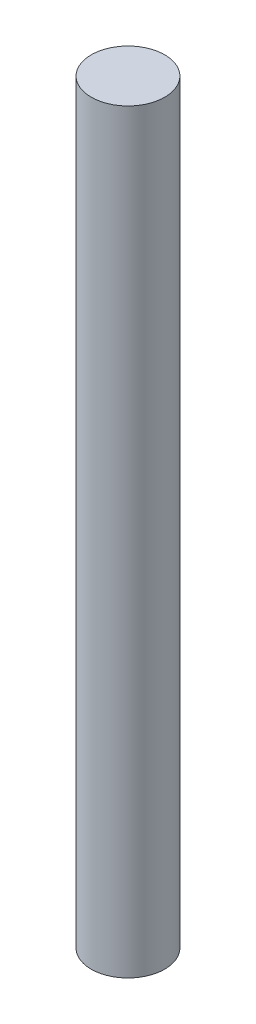
ISO-10303-21;
HEADER;
FILE_DESCRIPTION(('STEP AP214'),'2;1');
FILE_NAME('part.step','',(''),(''),'','','');
FILE_SCHEMA(('AUTOMOTIVE_DESIGN { 1 0 10303 214 1 1 1 1 }'));
ENDSEC;
DATA;
#1=APPLICATION_CONTEXT('core data for automotive mechanical design processes');
#2=APPLICATION_PROTOCOL_DEFINITION('international standard','automotive_design',2000,#1);
#3=PRODUCT_CONTEXT('',#1,'mechanical');
#4=PRODUCT('Part','Part','',(#3));
#5=PRODUCT_RELATED_PRODUCT_CATEGORY('part','',(#4));
#6=PRODUCT_DEFINITION_FORMATION('','',#4);
#7=PRODUCT_DEFINITION_CONTEXT('part definition',#1,'design');
#8=PRODUCT_DEFINITION('design','',#6,#7);
#9=PRODUCT_DEFINITION_SHAPE('','',#8);
#10=(LENGTH_UNIT() NAMED_UNIT(*) SI_UNIT(.MILLI.,.METRE.));
#11=(NAMED_UNIT(*) PLANE_ANGLE_UNIT() SI_UNIT($,.RADIAN.));
#12=(NAMED_UNIT(*) SI_UNIT($,.STERADIAN.) SOLID_ANGLE_UNIT());
#13=UNCERTAINTY_MEASURE_WITH_UNIT(LENGTH_MEASURE(1.E-05),#10,'distance_accuracy_value','');
#14=(GEOMETRIC_REPRESENTATION_CONTEXT(3) GLOBAL_UNCERTAINTY_ASSIGNED_CONTEXT((#13)) GLOBAL_UNIT_ASSIGNED_CONTEXT((#10,
#11,#12)) REPRESENTATION_CONTEXT('',''));
#15=CARTESIAN_POINT('',(0.,0.,0.));
#16=DIRECTION('',(0.,0.,1.));
#17=DIRECTION('',(1.,0.,0.));
#18=AXIS2_PLACEMENT_3D('',#15,#16,#17);
#19=CARTESIAN_POINT('',(0.,18796.,0.));
#20=DIRECTION('',(0.,-1.,0.));
#21=DIRECTION('',(0.,0.,-1.));
#22=AXIS2_PLACEMENT_3D('',#19,#20,#21);
#23=CYLINDRICAL_SURFACE('',#22,914.4);
#24=CARTESIAN_POINT('',(0.,18796.,0.));
#25=DIRECTION('',(0.,1.,0.));
#26=DIRECTION('',(0.,0.,1.));
#27=AXIS2_PLACEMENT_3D('',#24,#25,#26);
#28=CIRCLE('',#27,914.4);
#29=CARTESIAN_POINT('',(0.,18796.,914.4));
#30=VERTEX_POINT('',#29);
#31=EDGE_CURVE('E10',#30,#30,#28,.T.);
#32=ORIENTED_EDGE('',*,*,#31,.F.);
#33=EDGE_LOOP('',(#32));
#34=FACE_BOUND('',#33,.T.);
#35=CARTESIAN_POINT('',(0.,0.,0.));
#36=DIRECTION('',(0.,1.,0.));
#37=DIRECTION('',(0.,0.,1.));
#38=AXIS2_PLACEMENT_3D('',#35,#36,#37);
#39=CIRCLE('',#38,914.4);
#40=CARTESIAN_POINT('',(0.,0.,914.4));
#41=VERTEX_POINT('',#40);
#42=EDGE_CURVE('E40',#41,#41,#39,.T.);
#43=ORIENTED_EDGE('',*,*,#42,.T.);
#44=EDGE_LOOP('',(#43));
#45=FACE_BOUND('',#44,.T.);
#46=ADVANCED_FACE('F37',(#34,#45),#23,.T.);
#47=CARTESIAN_POINT('',(0.,18796.,0.));
#48=DIRECTION('',(0.,1.,0.));
#49=DIRECTION('',(0.,0.,1.));
#50=AXIS2_PLACEMENT_3D('',#47,#48,#49);
#51=PLANE('',#50);
#52=ORIENTED_EDGE('',*,*,#31,.T.);
#53=EDGE_LOOP('',(#52));
#54=FACE_BOUND('',#53,.T.);
#55=ADVANCED_FACE('F54',(#54),#51,.T.);
#56=CARTESIAN_POINT('',(0.,0.,0.));
#57=DIRECTION('',(0.,1.,0.));
#58=DIRECTION('',(0.,0.,1.));
#59=AXIS2_PLACEMENT_3D('',#56,#57,#58);
#60=PLANE('',#59);
#61=ORIENTED_EDGE('',*,*,#42,.F.);
#62=EDGE_LOOP('',(#61));
#63=FACE_BOUND('',#62,.T.);
#64=ADVANCED_FACE('F52',(#63),#60,.F.);
#65=CLOSED_SHELL('',(#46,#55,#64));
#66=MANIFOLD_SOLID_BREP('B2',#65);
#67=ADVANCED_BREP_SHAPE_REPRESENTATION('',(#18,#66),#14);
#68=SHAPE_DEFINITION_REPRESENTATION(#9,#67);
ENDSEC;
END-ISO-10303-21;
